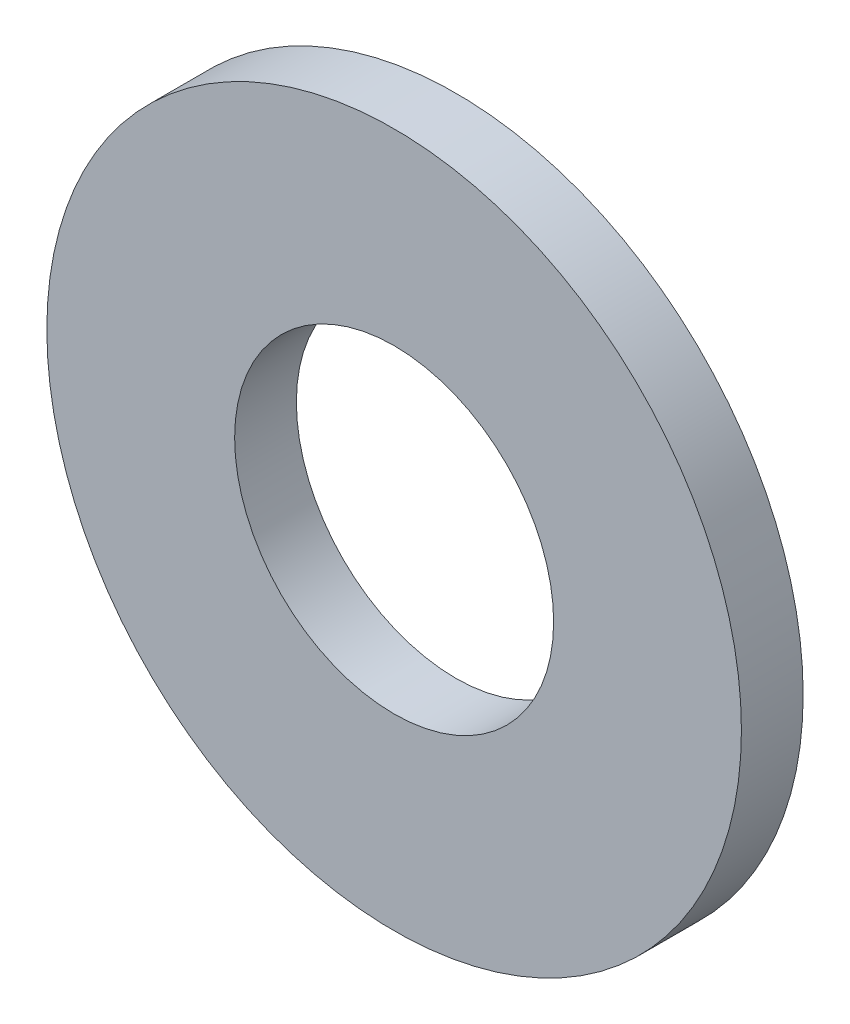
ISO-10303-21;
HEADER;
FILE_DESCRIPTION(('STEP AP214'),'2;1');
FILE_NAME('part.step','',(''),(''),'','','');
FILE_SCHEMA(('AUTOMOTIVE_DESIGN { 1 0 10303 214 1 1 1 1 }'));
ENDSEC;
DATA;
#1=APPLICATION_CONTEXT('core data for automotive mechanical design processes');
#2=APPLICATION_PROTOCOL_DEFINITION('international standard','automotive_design',2000,#1);
#3=PRODUCT_CONTEXT('',#1,'mechanical');
#4=PRODUCT('Part','Part','',(#3));
#5=PRODUCT_RELATED_PRODUCT_CATEGORY('part','',(#4));
#6=PRODUCT_DEFINITION_FORMATION('','',#4);
#7=PRODUCT_DEFINITION_CONTEXT('part definition',#1,'design');
#8=PRODUCT_DEFINITION('design','',#6,#7);
#9=PRODUCT_DEFINITION_SHAPE('','',#8);
#10=(LENGTH_UNIT() NAMED_UNIT(*) SI_UNIT(.MILLI.,.METRE.));
#11=(NAMED_UNIT(*) PLANE_ANGLE_UNIT() SI_UNIT($,.RADIAN.));
#12=(NAMED_UNIT(*) SI_UNIT($,.STERADIAN.) SOLID_ANGLE_UNIT());
#13=UNCERTAINTY_MEASURE_WITH_UNIT(LENGTH_MEASURE(1.E-05),#10,'distance_accuracy_value','');
#14=(GEOMETRIC_REPRESENTATION_CONTEXT(3) GLOBAL_UNCERTAINTY_ASSIGNED_CONTEXT((#13)) GLOBAL_UNIT_ASSIGNED_CONTEXT((#10,
#11,#12)) REPRESENTATION_CONTEXT('',''));
#15=CARTESIAN_POINT('',(0.,0.,0.));
#16=DIRECTION('',(0.,0.,1.));
#17=DIRECTION('',(1.,0.,0.));
#18=AXIS2_PLACEMENT_3D('',#15,#16,#17);
#19=CARTESIAN_POINT('',(0.,0.,0.6));
#20=DIRECTION('',(0.,0.,1.));
#21=DIRECTION('',(1.,0.,0.));
#22=AXIS2_PLACEMENT_3D('',#19,#20,#21);
#23=PLANE('',#22);
#24=CARTESIAN_POINT('',(0.,0.,0.6));
#25=DIRECTION('',(0.,0.,1.));
#26=DIRECTION('',(1.,0.,0.));
#27=AXIS2_PLACEMENT_3D('',#24,#25,#26);
#28=CIRCLE('',#27,3.375);
#29=CARTESIAN_POINT('',(3.375,0.,0.6));
#30=VERTEX_POINT('',#29);
#31=EDGE_CURVE('E10',#30,#30,#28,.T.);
#32=ORIENTED_EDGE('',*,*,#31,.T.);
#33=EDGE_LOOP('',(#32));
#34=FACE_BOUND('',#33,.T.);
#35=CARTESIAN_POINT('',(0.,0.,0.6));
#36=DIRECTION('',(0.,0.,1.));
#37=DIRECTION('',(1.,0.,0.));
#38=AXIS2_PLACEMENT_3D('',#35,#36,#37);
#39=CIRCLE('',#38,1.55);
#40=CARTESIAN_POINT('',(1.55,0.,0.6));
#41=VERTEX_POINT('',#40);
#42=EDGE_CURVE('E42',#41,#41,#39,.T.);
#43=ORIENTED_EDGE('',*,*,#42,.F.);
#44=EDGE_LOOP('',(#43));
#45=FACE_BOUND('',#44,.T.);
#46=ADVANCED_FACE('F31',(#34,#45),#23,.T.);
#47=CARTESIAN_POINT('',(0.,0.,0.));
#48=DIRECTION('',(0.,0.,1.));
#49=DIRECTION('',(1.,0.,0.));
#50=AXIS2_PLACEMENT_3D('',#47,#48,#49);
#51=PLANE('',#50);
#52=CARTESIAN_POINT('',(0.,0.,0.));
#53=DIRECTION('',(0.,0.,1.));
#54=DIRECTION('',(1.,0.,0.));
#55=AXIS2_PLACEMENT_3D('',#52,#53,#54);
#56=CIRCLE('',#55,3.375);
#57=CARTESIAN_POINT('',(3.375,0.,0.));
#58=VERTEX_POINT('',#57);
#59=EDGE_CURVE('E35',#58,#58,#56,.T.);
#60=ORIENTED_EDGE('',*,*,#59,.F.);
#61=EDGE_LOOP('',(#60));
#62=FACE_BOUND('',#61,.T.);
#63=CARTESIAN_POINT('',(0.,0.,0.));
#64=DIRECTION('',(0.,0.,1.));
#65=DIRECTION('',(1.,0.,0.));
#66=AXIS2_PLACEMENT_3D('',#63,#64,#65);
#67=CIRCLE('',#66,1.55);
#68=CARTESIAN_POINT('',(1.55,0.,0.));
#69=VERTEX_POINT('',#68);
#70=EDGE_CURVE('E44',#69,#69,#67,.T.);
#71=ORIENTED_EDGE('',*,*,#70,.T.);
#72=EDGE_LOOP('',(#71));
#73=FACE_BOUND('',#72,.T.);
#74=ADVANCED_FACE('F54',(#62,#73),#51,.F.);
#75=CARTESIAN_POINT('',(0.,0.,0.6));
#76=DIRECTION('',(0.,0.,-1.));
#77=DIRECTION('',(-1.,0.,0.));
#78=AXIS2_PLACEMENT_3D('',#75,#76,#77);
#79=CYLINDRICAL_SURFACE('',#78,3.375);
#80=ORIENTED_EDGE('',*,*,#31,.F.);
#81=EDGE_LOOP('',(#80));
#82=FACE_BOUND('',#81,.T.);
#83=ORIENTED_EDGE('',*,*,#59,.T.);
#84=EDGE_LOOP('',(#83));
#85=FACE_BOUND('',#84,.T.);
#86=ADVANCED_FACE('F33',(#82,#85),#79,.T.);
#87=CARTESIAN_POINT('',(0.,0.,0.6));
#88=DIRECTION('',(0.,0.,-1.));
#89=DIRECTION('',(-1.,0.,0.));
#90=AXIS2_PLACEMENT_3D('',#87,#88,#89);
#91=CYLINDRICAL_SURFACE('',#90,1.55);
#92=ORIENTED_EDGE('',*,*,#42,.T.);
#93=EDGE_LOOP('',(#92));
#94=FACE_BOUND('',#93,.T.);
#95=ORIENTED_EDGE('',*,*,#70,.F.);
#96=EDGE_LOOP('',(#95));
#97=FACE_BOUND('',#96,.T.);
#98=ADVANCED_FACE('F50',(#94,#97),#91,.F.);
#99=CLOSED_SHELL('',(#46,#74,#86,#98));
#100=MANIFOLD_SOLID_BREP('B2',#99);
#101=ADVANCED_BREP_SHAPE_REPRESENTATION('',(#18,#100),#14);
#102=SHAPE_DEFINITION_REPRESENTATION(#9,#101);
ENDSEC;
END-ISO-10303-21;
